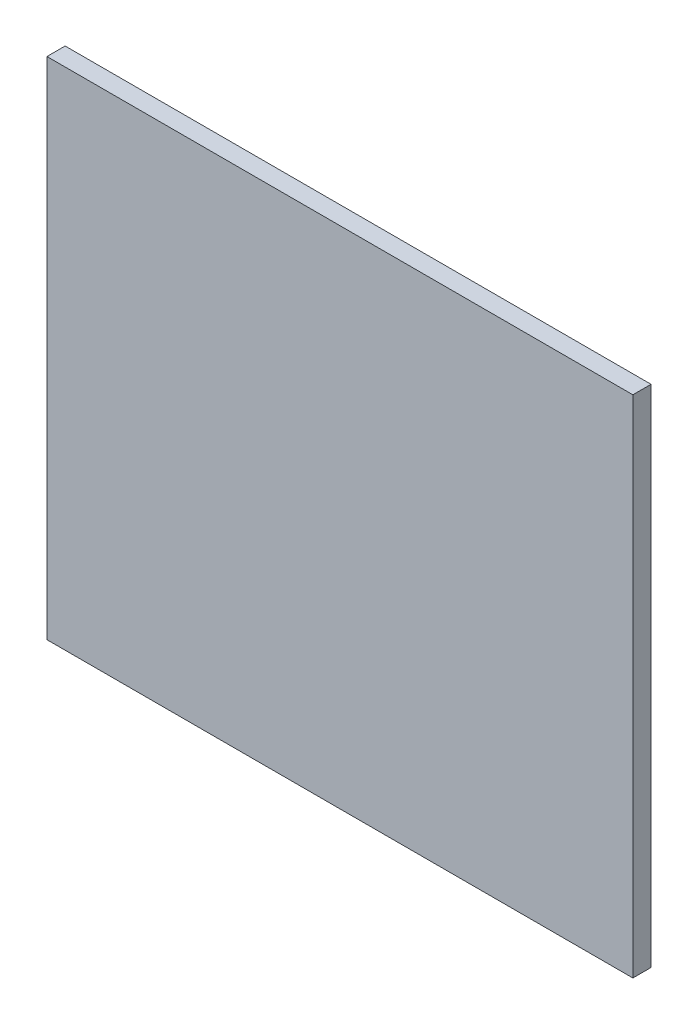
ISO-10303-21;
HEADER;
FILE_DESCRIPTION(('STEP AP214'),'2;1');
FILE_NAME('part.step','',(''),(''),'','','');
FILE_SCHEMA(('AUTOMOTIVE_DESIGN { 1 0 10303 214 1 1 1 1 }'));
ENDSEC;
DATA;
#1=APPLICATION_CONTEXT('core data for automotive mechanical design processes');
#2=APPLICATION_PROTOCOL_DEFINITION('international standard','automotive_design',2000,#1);
#3=PRODUCT_CONTEXT('',#1,'mechanical');
#4=PRODUCT('Part','Part','',(#3));
#5=PRODUCT_RELATED_PRODUCT_CATEGORY('part','',(#4));
#6=PRODUCT_DEFINITION_FORMATION('','',#4);
#7=PRODUCT_DEFINITION_CONTEXT('part definition',#1,'design');
#8=PRODUCT_DEFINITION('design','',#6,#7);
#9=PRODUCT_DEFINITION_SHAPE('','',#8);
#10=(LENGTH_UNIT() NAMED_UNIT(*) SI_UNIT(.MILLI.,.METRE.));
#11=(NAMED_UNIT(*) PLANE_ANGLE_UNIT() SI_UNIT($,.RADIAN.));
#12=(NAMED_UNIT(*) SI_UNIT($,.STERADIAN.) SOLID_ANGLE_UNIT());
#13=UNCERTAINTY_MEASURE_WITH_UNIT(LENGTH_MEASURE(1.E-05),#10,'distance_accuracy_value','');
#14=(GEOMETRIC_REPRESENTATION_CONTEXT(3) GLOBAL_UNCERTAINTY_ASSIGNED_CONTEXT((#13)) GLOBAL_UNIT_ASSIGNED_CONTEXT((#10,
#11,#12)) REPRESENTATION_CONTEXT('',''));
#15=CARTESIAN_POINT('',(0.,0.,0.));
#16=DIRECTION('',(0.,0.,1.));
#17=DIRECTION('',(1.,0.,0.));
#18=AXIS2_PLACEMENT_3D('',#15,#16,#17);
#19=CARTESIAN_POINT('',(0.,0.,9.));
#20=DIRECTION('',(1.,0.,0.));
#21=DIRECTION('',(0.,0.,-1.));
#22=AXIS2_PLACEMENT_3D('',#19,#20,#21);
#23=PLANE('',#22);
#24=DIRECTION('',(0.,-1.,0.));
#25=VECTOR('',#24,1.);
#26=CARTESIAN_POINT('',(0.,0.,0.));
#27=LINE('',#26,#25);
#28=CARTESIAN_POINT('',(0.,250.,0.));
#29=VERTEX_POINT('',#28);
#30=CARTESIAN_POINT('',(0.,0.,0.));
#31=VERTEX_POINT('',#30);
#32=EDGE_CURVE('E96',#29,#31,#27,.T.);
#33=ORIENTED_EDGE('',*,*,#32,.T.);
#34=DIRECTION('',(0.,0.,-1.));
#35=VECTOR('',#34,1.);
#36=CARTESIAN_POINT('',(0.,0.,9.));
#37=LINE('',#36,#35);
#38=CARTESIAN_POINT('',(0.,0.,9.));
#39=VERTEX_POINT('',#38);
#40=EDGE_CURVE('E11',#39,#31,#37,.T.);
#41=ORIENTED_EDGE('',*,*,#40,.F.);
#42=DIRECTION('',(0.,-1.,0.));
#43=VECTOR('',#42,1.);
#44=CARTESIAN_POINT('',(0.,0.,9.));
#45=LINE('',#44,#43);
#46=CARTESIAN_POINT('',(0.,250.,9.));
#47=VERTEX_POINT('',#46);
#48=EDGE_CURVE('E84',#47,#39,#45,.T.);
#49=ORIENTED_EDGE('',*,*,#48,.F.);
#50=DIRECTION('',(0.,0.,-1.));
#51=VECTOR('',#50,1.);
#52=CARTESIAN_POINT('',(0.,250.,9.));
#53=LINE('',#52,#51);
#54=EDGE_CURVE('E92',#47,#29,#53,.T.);
#55=ORIENTED_EDGE('',*,*,#54,.T.);
#56=EDGE_LOOP('',(#33,#41,#49,#55));
#57=FACE_BOUND('',#56,.T.);
#58=ADVANCED_FACE('F33',(#57),#23,.F.);
#59=CARTESIAN_POINT('',(0.,0.,9.));
#60=DIRECTION('',(0.,1.,0.));
#61=DIRECTION('',(0.,0.,1.));
#62=AXIS2_PLACEMENT_3D('',#59,#60,#61);
#63=PLANE('',#62);
#64=DIRECTION('',(1.,0.,0.));
#65=VECTOR('',#64,1.);
#66=CARTESIAN_POINT('',(0.,0.,0.));
#67=LINE('',#66,#65);
#68=CARTESIAN_POINT('',(290.,0.,0.));
#69=VERTEX_POINT('',#68);
#70=EDGE_CURVE('E88',#31,#69,#67,.T.);
#71=ORIENTED_EDGE('',*,*,#70,.T.);
#72=DIRECTION('',(0.,0.,-1.));
#73=VECTOR('',#72,1.);
#74=CARTESIAN_POINT('',(290.,0.,9.));
#75=LINE('',#74,#73);
#76=CARTESIAN_POINT('',(290.,0.,9.));
#77=VERTEX_POINT('',#76);
#78=EDGE_CURVE('E41',#77,#69,#75,.T.);
#79=ORIENTED_EDGE('',*,*,#78,.F.);
#80=DIRECTION('',(1.,0.,0.));
#81=VECTOR('',#80,1.);
#82=CARTESIAN_POINT('',(0.,0.,9.));
#83=LINE('',#82,#81);
#84=EDGE_CURVE('E79',#39,#77,#83,.T.);
#85=ORIENTED_EDGE('',*,*,#84,.F.);
#86=ORIENTED_EDGE('',*,*,#40,.T.);
#87=EDGE_LOOP('',(#71,#79,#85,#86));
#88=FACE_BOUND('',#87,.T.);
#89=ADVANCED_FACE('F87',(#88),#63,.F.);
#90=CARTESIAN_POINT('',(290.,0.,9.));
#91=DIRECTION('',(-1.,0.,0.));
#92=DIRECTION('',(0.,0.,1.));
#93=AXIS2_PLACEMENT_3D('',#90,#91,#92);
#94=PLANE('',#93);
#95=DIRECTION('',(0.,1.,0.));
#96=VECTOR('',#95,1.);
#97=CARTESIAN_POINT('',(290.,0.,0.));
#98=LINE('',#97,#96);
#99=CARTESIAN_POINT('',(290.,250.,0.));
#100=VERTEX_POINT('',#99);
#101=EDGE_CURVE('E66',#69,#100,#98,.T.);
#102=ORIENTED_EDGE('',*,*,#101,.T.);
#103=DIRECTION('',(0.,0.,-1.));
#104=VECTOR('',#103,1.);
#105=CARTESIAN_POINT('',(290.,250.,9.));
#106=LINE('',#105,#104);
#107=CARTESIAN_POINT('',(290.,250.,9.));
#108=VERTEX_POINT('',#107);
#109=EDGE_CURVE('E89',#108,#100,#106,.T.);
#110=ORIENTED_EDGE('',*,*,#109,.F.);
#111=DIRECTION('',(0.,1.,0.));
#112=VECTOR('',#111,1.);
#113=CARTESIAN_POINT('',(290.,0.,9.));
#114=LINE('',#113,#112);
#115=EDGE_CURVE('E82',#77,#108,#114,.T.);
#116=ORIENTED_EDGE('',*,*,#115,.F.);
#117=ORIENTED_EDGE('',*,*,#78,.T.);
#118=EDGE_LOOP('',(#102,#110,#116,#117));
#119=FACE_BOUND('',#118,.T.);
#120=ADVANCED_FACE('F90',(#119),#94,.F.);
#121=CARTESIAN_POINT('',(0.,250.,9.));
#122=DIRECTION('',(0.,-1.,0.));
#123=DIRECTION('',(0.,0.,-1.));
#124=AXIS2_PLACEMENT_3D('',#121,#122,#123);
#125=PLANE('',#124);
#126=DIRECTION('',(-1.,0.,0.));
#127=VECTOR('',#126,1.);
#128=CARTESIAN_POINT('',(0.,250.,0.));
#129=LINE('',#128,#127);
#130=EDGE_CURVE('E72',#100,#29,#129,.T.);
#131=ORIENTED_EDGE('',*,*,#130,.T.);
#132=ORIENTED_EDGE('',*,*,#54,.F.);
#133=DIRECTION('',(-1.,0.,0.));
#134=VECTOR('',#133,1.);
#135=CARTESIAN_POINT('',(0.,250.,9.));
#136=LINE('',#135,#134);
#137=EDGE_CURVE('E49',#108,#47,#136,.T.);
#138=ORIENTED_EDGE('',*,*,#137,.F.);
#139=ORIENTED_EDGE('',*,*,#109,.T.);
#140=EDGE_LOOP('',(#131,#132,#138,#139));
#141=FACE_BOUND('',#140,.T.);
#142=ADVANCED_FACE('F103',(#141),#125,.F.);
#143=CARTESIAN_POINT('',(0.,0.,9.));
#144=DIRECTION('',(0.,0.,-1.));
#145=DIRECTION('',(-1.,0.,0.));
#146=AXIS2_PLACEMENT_3D('',#143,#144,#145);
#147=PLANE('',#146);
#148=ORIENTED_EDGE('',*,*,#48,.T.);
#149=ORIENTED_EDGE('',*,*,#84,.T.);
#150=ORIENTED_EDGE('',*,*,#115,.T.);
#151=ORIENTED_EDGE('',*,*,#137,.T.);
#152=EDGE_LOOP('',(#148,#149,#150,#151));
#153=FACE_BOUND('',#152,.T.);
#154=ADVANCED_FACE('F80',(#153),#147,.F.);
#155=CARTESIAN_POINT('',(0.,0.,0.));
#156=DIRECTION('',(0.,0.,-1.));
#157=DIRECTION('',(-1.,0.,0.));
#158=AXIS2_PLACEMENT_3D('',#155,#156,#157);
#159=PLANE('',#158);
#160=ORIENTED_EDGE('',*,*,#32,.F.);
#161=ORIENTED_EDGE('',*,*,#130,.F.);
#162=ORIENTED_EDGE('',*,*,#101,.F.);
#163=ORIENTED_EDGE('',*,*,#70,.F.);
#164=EDGE_LOOP('',(#160,#161,#162,#163));
#165=FACE_BOUND('',#164,.T.);
#166=ADVANCED_FACE('F106',(#165),#159,.T.);
#167=CLOSED_SHELL('',(#58,#89,#120,#142,#154,#166));
#168=MANIFOLD_SOLID_BREP('B2',#167);
#169=ADVANCED_BREP_SHAPE_REPRESENTATION('',(#18,#168),#14);
#170=SHAPE_DEFINITION_REPRESENTATION(#9,#169);
ENDSEC;
END-ISO-10303-21;
